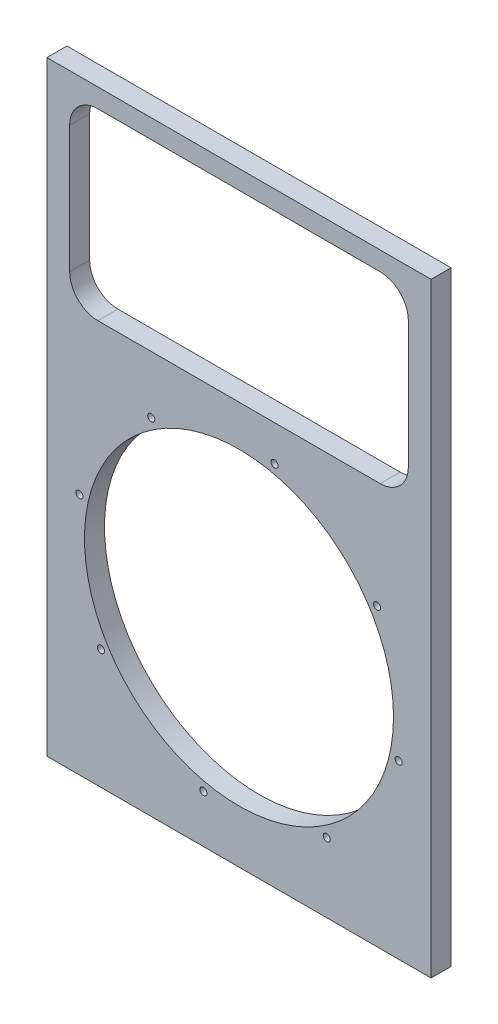
ISO-10303-21;
HEADER;
FILE_DESCRIPTION(('STEP AP214'),'2;1');
FILE_NAME('part.step','',(''),(''),'','','');
FILE_SCHEMA(('AUTOMOTIVE_DESIGN { 1 0 10303 214 1 1 1 1 }'));
ENDSEC;
DATA;
#1=APPLICATION_CONTEXT('core data for automotive mechanical design processes');
#2=APPLICATION_PROTOCOL_DEFINITION('international standard','automotive_design',2000,#1);
#3=PRODUCT_CONTEXT('',#1,'mechanical');
#4=PRODUCT('Part','Part','',(#3));
#5=PRODUCT_RELATED_PRODUCT_CATEGORY('part','',(#4));
#6=PRODUCT_DEFINITION_FORMATION('','',#4);
#7=PRODUCT_DEFINITION_CONTEXT('part definition',#1,'design');
#8=PRODUCT_DEFINITION('design','',#6,#7);
#9=PRODUCT_DEFINITION_SHAPE('','',#8);
#10=(LENGTH_UNIT() NAMED_UNIT(*) SI_UNIT(.MILLI.,.METRE.));
#11=(NAMED_UNIT(*) PLANE_ANGLE_UNIT() SI_UNIT($,.RADIAN.));
#12=(NAMED_UNIT(*) SI_UNIT($,.STERADIAN.) SOLID_ANGLE_UNIT());
#13=UNCERTAINTY_MEASURE_WITH_UNIT(LENGTH_MEASURE(1.E-05),#10,'distance_accuracy_value','');
#14=(GEOMETRIC_REPRESENTATION_CONTEXT(3) GLOBAL_UNCERTAINTY_ASSIGNED_CONTEXT((#13)) GLOBAL_UNIT_ASSIGNED_CONTEXT((#10,
#11,#12)) REPRESENTATION_CONTEXT('',''));
#15=CARTESIAN_POINT('',(0.,0.,0.));
#16=DIRECTION('',(0.,0.,1.));
#17=DIRECTION('',(1.,0.,0.));
#18=AXIS2_PLACEMENT_3D('',#15,#16,#17);
#19=CARTESIAN_POINT('',(0.,0.,18.));
#20=DIRECTION('',(1.,0.,0.));
#21=DIRECTION('',(0.,0.,-1.));
#22=AXIS2_PLACEMENT_3D('',#19,#20,#21);
#23=PLANE('',#22);
#24=DIRECTION('',(0.,-1.,0.));
#25=VECTOR('',#24,1.);
#26=CARTESIAN_POINT('',(0.,0.,0.));
#27=LINE('',#26,#25);
#28=CARTESIAN_POINT('',(0.,544.6,0.));
#29=VERTEX_POINT('',#28);
#30=CARTESIAN_POINT('',(0.,0.,0.));
#31=VERTEX_POINT('',#30);
#32=EDGE_CURVE('E243',#29,#31,#27,.T.);
#33=ORIENTED_EDGE('',*,*,#32,.T.);
#34=DIRECTION('',(0.,0.,-1.));
#35=VECTOR('',#34,1.);
#36=CARTESIAN_POINT('',(0.,0.,18.));
#37=LINE('',#36,#35);
#38=CARTESIAN_POINT('',(0.,0.,18.));
#39=VERTEX_POINT('',#38);
#40=EDGE_CURVE('E11',#39,#31,#37,.T.);
#41=ORIENTED_EDGE('',*,*,#40,.F.);
#42=DIRECTION('',(0.,-1.,0.));
#43=VECTOR('',#42,1.);
#44=CARTESIAN_POINT('',(0.,0.,18.));
#45=LINE('',#44,#43);
#46=CARTESIAN_POINT('',(0.,544.6,18.));
#47=VERTEX_POINT('',#46);
#48=EDGE_CURVE('E246',#47,#39,#45,.T.);
#49=ORIENTED_EDGE('',*,*,#48,.F.);
#50=DIRECTION('',(0.,0.,-1.));
#51=VECTOR('',#50,1.);
#52=CARTESIAN_POINT('',(0.,544.6,18.));
#53=LINE('',#52,#51);
#54=EDGE_CURVE('E256',#47,#29,#53,.T.);
#55=ORIENTED_EDGE('',*,*,#54,.T.);
#56=EDGE_LOOP('',(#33,#41,#49,#55));
#57=FACE_BOUND('',#56,.T.);
#58=ADVANCED_FACE('F35',(#57),#23,.F.);
#59=CARTESIAN_POINT('',(0.,0.,18.));
#60=DIRECTION('',(0.,1.,0.));
#61=DIRECTION('',(0.,0.,1.));
#62=AXIS2_PLACEMENT_3D('',#59,#60,#61);
#63=PLANE('',#62);
#64=DIRECTION('',(1.,0.,0.));
#65=VECTOR('',#64,1.);
#66=CARTESIAN_POINT('',(0.,0.,0.));
#67=LINE('',#66,#65);
#68=CARTESIAN_POINT('',(345.7,0.,0.));
#69=VERTEX_POINT('',#68);
#70=EDGE_CURVE('E259',#31,#69,#67,.T.);
#71=ORIENTED_EDGE('',*,*,#70,.T.);
#72=DIRECTION('',(0.,0.,-1.));
#73=VECTOR('',#72,1.);
#74=CARTESIAN_POINT('',(345.7,0.,18.));
#75=LINE('',#74,#73);
#76=CARTESIAN_POINT('',(345.7,0.,18.));
#77=VERTEX_POINT('',#76);
#78=EDGE_CURVE('E42',#77,#69,#75,.T.);
#79=ORIENTED_EDGE('',*,*,#78,.F.);
#80=DIRECTION('',(1.,0.,0.));
#81=VECTOR('',#80,1.);
#82=CARTESIAN_POINT('',(0.,0.,18.));
#83=LINE('',#82,#81);
#84=EDGE_CURVE('E249',#39,#77,#83,.T.);
#85=ORIENTED_EDGE('',*,*,#84,.F.);
#86=ORIENTED_EDGE('',*,*,#40,.T.);
#87=EDGE_LOOP('',(#71,#79,#85,#86));
#88=FACE_BOUND('',#87,.T.);
#89=ADVANCED_FACE('F288',(#88),#63,.F.);
#90=CARTESIAN_POINT('',(345.7,0.,18.));
#91=DIRECTION('',(-1.,0.,0.));
#92=DIRECTION('',(0.,0.,1.));
#93=AXIS2_PLACEMENT_3D('',#90,#91,#92);
#94=PLANE('',#93);
#95=DIRECTION('',(0.,1.,0.));
#96=VECTOR('',#95,1.);
#97=CARTESIAN_POINT('',(345.7,0.,0.));
#98=LINE('',#97,#96);
#99=CARTESIAN_POINT('',(345.7,544.6,0.));
#100=VERTEX_POINT('',#99);
#101=EDGE_CURVE('E261',#69,#100,#98,.T.);
#102=ORIENTED_EDGE('',*,*,#101,.T.);
#103=DIRECTION('',(0.,0.,-1.));
#104=VECTOR('',#103,1.);
#105=CARTESIAN_POINT('',(345.7,544.6,18.));
#106=LINE('',#105,#104);
#107=CARTESIAN_POINT('',(345.7,544.6,18.));
#108=VERTEX_POINT('',#107);
#109=EDGE_CURVE('E266',#108,#100,#106,.T.);
#110=ORIENTED_EDGE('',*,*,#109,.F.);
#111=DIRECTION('',(0.,1.,0.));
#112=VECTOR('',#111,1.);
#113=CARTESIAN_POINT('',(345.7,0.,18.));
#114=LINE('',#113,#112);
#115=EDGE_CURVE('E252',#77,#108,#114,.T.);
#116=ORIENTED_EDGE('',*,*,#115,.F.);
#117=ORIENTED_EDGE('',*,*,#78,.T.);
#118=EDGE_LOOP('',(#102,#110,#116,#117));
#119=FACE_BOUND('',#118,.T.);
#120=ADVANCED_FACE('F273',(#119),#94,.F.);
#121=CARTESIAN_POINT('',(0.,544.6,18.));
#122=DIRECTION('',(0.,-1.,0.));
#123=DIRECTION('',(0.,0.,-1.));
#124=AXIS2_PLACEMENT_3D('',#121,#122,#123);
#125=PLANE('',#124);
#126=DIRECTION('',(-1.,0.,0.));
#127=VECTOR('',#126,1.);
#128=CARTESIAN_POINT('',(0.,544.6,0.));
#129=LINE('',#128,#127);
#130=EDGE_CURVE('E250',#100,#29,#129,.T.);
#131=ORIENTED_EDGE('',*,*,#130,.T.);
#132=ORIENTED_EDGE('',*,*,#54,.F.);
#133=DIRECTION('',(-1.,0.,0.));
#134=VECTOR('',#133,1.);
#135=CARTESIAN_POINT('',(0.,544.6,18.));
#136=LINE('',#135,#134);
#137=EDGE_CURVE('E254',#108,#47,#136,.T.);
#138=ORIENTED_EDGE('',*,*,#137,.F.);
#139=ORIENTED_EDGE('',*,*,#109,.T.);
#140=EDGE_LOOP('',(#131,#132,#138,#139));
#141=FACE_BOUND('',#140,.T.);
#142=ADVANCED_FACE('F281',(#141),#125,.F.);
#143=CARTESIAN_POINT('',(0.,0.,18.));
#144=DIRECTION('',(0.,0.,-1.));
#145=DIRECTION('',(-1.,0.,0.));
#146=AXIS2_PLACEMENT_3D('',#143,#144,#145);
#147=PLANE('',#146);
#148=DIRECTION('',(1.,0.,0.));
#149=VECTOR('',#148,1.);
#150=CARTESIAN_POINT('',(45.8500000000002,362.45,18.));
#151=LINE('',#150,#149);
#152=CARTESIAN_POINT('',(45.8500000000002,362.45,18.));
#153=VERTEX_POINT('',#152);
#154=CARTESIAN_POINT('',(299.85,362.45,18.));
#155=VERTEX_POINT('',#154);
#156=EDGE_CURVE('E162',#153,#155,#151,.T.);
#157=ORIENTED_EDGE('',*,*,#156,.F.);
#158=CARTESIAN_POINT('',(45.85,387.85,18.));
#159=DIRECTION('',(0.,0.,1.));
#160=DIRECTION('',(-1.,0.,0.));
#161=AXIS2_PLACEMENT_3D('',#158,#159,#160);
#162=CIRCLE('',#161,25.4);
#163=CARTESIAN_POINT('',(20.45,387.85,18.));
#164=VERTEX_POINT('',#163);
#165=EDGE_CURVE('E49',#164,#153,#162,.T.);
#166=ORIENTED_EDGE('',*,*,#165,.F.);
#167=DIRECTION('',(0.,-1.,0.));
#168=VECTOR('',#167,1.);
#169=CARTESIAN_POINT('',(20.45,387.85,18.));
#170=LINE('',#169,#168);
#171=CARTESIAN_POINT('',(20.45,502.15,18.));
#172=VERTEX_POINT('',#171);
#173=EDGE_CURVE('E142',#172,#164,#170,.T.);
#174=ORIENTED_EDGE('',*,*,#173,.F.);
#175=CARTESIAN_POINT('',(45.85,502.15,18.));
#176=DIRECTION('',(0.,0.,1.));
#177=DIRECTION('',(-1.,0.,0.));
#178=AXIS2_PLACEMENT_3D('',#175,#176,#177);
#179=CIRCLE('',#178,25.4);
#180=CARTESIAN_POINT('',(45.8500000000002,527.55,18.));
#181=VERTEX_POINT('',#180);
#182=EDGE_CURVE('E145',#181,#172,#179,.T.);
#183=ORIENTED_EDGE('',*,*,#182,.F.);
#184=DIRECTION('',(-1.,0.,0.));
#185=VECTOR('',#184,1.);
#186=CARTESIAN_POINT('',(45.8500000000002,527.55,18.));
#187=LINE('',#186,#185);
#188=CARTESIAN_POINT('',(299.85,527.55,18.));
#189=VERTEX_POINT('',#188);
#190=EDGE_CURVE('E173',#189,#181,#187,.T.);
#191=ORIENTED_EDGE('',*,*,#190,.F.);
#192=CARTESIAN_POINT('',(299.85,502.15,18.));
#193=DIRECTION('',(0.,0.,1.));
#194=DIRECTION('',(-1.,0.,0.));
#195=AXIS2_PLACEMENT_3D('',#192,#193,#194);
#196=CIRCLE('',#195,25.4);
#197=CARTESIAN_POINT('',(325.25,502.15,18.));
#198=VERTEX_POINT('',#197);
#199=EDGE_CURVE('E170',#198,#189,#196,.T.);
#200=ORIENTED_EDGE('',*,*,#199,.F.);
#201=DIRECTION('',(0.,1.,0.));
#202=VECTOR('',#201,1.);
#203=CARTESIAN_POINT('',(325.25,387.85,18.));
#204=LINE('',#203,#202);
#205=CARTESIAN_POINT('',(325.25,387.85,18.));
#206=VERTEX_POINT('',#205);
#207=EDGE_CURVE('E167',#206,#198,#204,.T.);
#208=ORIENTED_EDGE('',*,*,#207,.F.);
#209=CARTESIAN_POINT('',(299.85,387.85,18.));
#210=DIRECTION('',(0.,0.,1.));
#211=DIRECTION('',(1.,0.,0.));
#212=AXIS2_PLACEMENT_3D('',#209,#210,#211);
#213=CIRCLE('',#212,25.4);
#214=EDGE_CURVE('E164',#155,#206,#213,.T.);
#215=ORIENTED_EDGE('',*,*,#214,.F.);
#216=EDGE_LOOP('',(#157,#166,#174,#183,#191,#200,#208,#215));
#217=FACE_BOUND('',#216,.T.);
#218=CARTESIAN_POINT('',(93.8788571551372,310.905851568658,18.));
#219=DIRECTION('',(0.,0.,1.));
#220=DIRECTION('',(1.,0.,0.));
#221=AXIS2_PLACEMENT_3D('',#218,#219,#220);
#222=CIRCLE('',#221,3.17499999999666);
#223=CARTESIAN_POINT('',(97.0538571551338,310.905851568658,18.));
#224=VERTEX_POINT('',#223);
#225=EDGE_CURVE('E180',#224,#224,#222,.T.);
#226=ORIENTED_EDGE('',*,*,#225,.F.);
#227=EDGE_LOOP('',(#226));
#228=FACE_BOUND('',#227,.T.);
#229=CARTESIAN_POINT('',(29.1757813242883,218.683123227375,18.));
#230=DIRECTION('',(0.,0.,1.));
#231=DIRECTION('',(1.,0.,0.));
#232=AXIS2_PLACEMENT_3D('',#229,#230,#231);
#233=CIRCLE('',#232,3.17499999999039);
#234=CARTESIAN_POINT('',(32.3507813242787,218.683123227375,18.));
#235=VERTEX_POINT('',#234);
#236=EDGE_CURVE('E195',#235,#235,#233,.T.);
#237=ORIENTED_EDGE('',*,*,#236,.F.);
#238=EDGE_LOOP('',(#237));
#239=FACE_BOUND('',#238,.T.);
#240=CARTESIAN_POINT('',(48.6351142303137,107.719822954109,18.));
#241=DIRECTION('',(0.,0.,1.));
#242=DIRECTION('',(1.,0.,0.));
#243=AXIS2_PLACEMENT_3D('',#240,#241,#242);
#244=CIRCLE('',#243,3.17499999998635);
#245=CARTESIAN_POINT('',(51.8101142303,107.719822954109,18.));
#246=VERTEX_POINT('',#245);
#247=EDGE_CURVE('E201',#246,#246,#244,.T.);
#248=ORIENTED_EDGE('',*,*,#247,.F.);
#249=EDGE_LOOP('',(#248));
#250=FACE_BOUND('',#249,.T.);
#251=CARTESIAN_POINT('',(140.857842571597,43.0167471232602,18.));
#252=DIRECTION('',(0.,0.,1.));
#253=DIRECTION('',(1.,0.,0.));
#254=AXIS2_PLACEMENT_3D('',#251,#252,#253);
#255=CIRCLE('',#254,3.1749999999869);
#256=CARTESIAN_POINT('',(144.032842571583,43.0167471232602,18.));
#257=VERTEX_POINT('',#256);
#258=EDGE_CURVE('E207',#257,#257,#255,.T.);
#259=ORIENTED_EDGE('',*,*,#258,.F.);
#260=EDGE_LOOP('',(#259));
#261=FACE_BOUND('',#260,.T.);
#262=CARTESIAN_POINT('',(251.821142844863,62.4760800292856,18.));
#263=DIRECTION('',(0.,0.,1.));
#264=DIRECTION('',(1.,0.,0.));
#265=AXIS2_PLACEMENT_3D('',#262,#263,#264);
#266=CIRCLE('',#265,3.17499999999172);
#267=CARTESIAN_POINT('',(254.996142844855,62.4760800292856,18.));
#268=VERTEX_POINT('',#267);
#269=EDGE_CURVE('E213',#268,#268,#266,.T.);
#270=ORIENTED_EDGE('',*,*,#269,.F.);
#271=EDGE_LOOP('',(#270));
#272=FACE_BOUND('',#271,.T.);
#273=CARTESIAN_POINT('',(316.524218675712,154.698808370568,18.));
#274=DIRECTION('',(0.,0.,1.));
#275=DIRECTION('',(1.,0.,0.));
#276=AXIS2_PLACEMENT_3D('',#273,#274,#275);
#277=CIRCLE('',#276,3.17499999999751);
#278=CARTESIAN_POINT('',(319.699218675709,154.698808370568,18.));
#279=VERTEX_POINT('',#278);
#280=EDGE_CURVE('E219',#279,#279,#277,.T.);
#281=ORIENTED_EDGE('',*,*,#280,.F.);
#282=EDGE_LOOP('',(#281));
#283=FACE_BOUND('',#282,.T.);
#284=CARTESIAN_POINT('',(297.064885769687,265.662108643835,18.));
#285=DIRECTION('',(0.,0.,1.));
#286=DIRECTION('',(1.,0.,0.));
#287=AXIS2_PLACEMENT_3D('',#284,#285,#286);
#288=CIRCLE('',#287,3.175000000001);
#289=CARTESIAN_POINT('',(300.239885769688,265.662108643835,18.));
#290=VERTEX_POINT('',#289);
#291=EDGE_CURVE('E225',#290,#290,#288,.T.);
#292=ORIENTED_EDGE('',*,*,#291,.F.);
#293=EDGE_LOOP('',(#292));
#294=FACE_BOUND('',#293,.T.);
#295=CARTESIAN_POINT('',(204.842157428404,330.365184474684,18.));
#296=DIRECTION('',(0.,0.,1.));
#297=DIRECTION('',(1.,0.,0.));
#298=AXIS2_PLACEMENT_3D('',#295,#296,#297);
#299=CIRCLE('',#298,3.175);
#300=CARTESIAN_POINT('',(208.017157428404,330.365184474684,18.));
#301=VERTEX_POINT('',#300);
#302=EDGE_CURVE('E231',#301,#301,#299,.T.);
#303=ORIENTED_EDGE('',*,*,#302,.F.);
#304=EDGE_LOOP('',(#303));
#305=FACE_BOUND('',#304,.T.);
#306=CARTESIAN_POINT('',(172.85,186.690965798972,18.));
#307=DIRECTION('',(0.,0.,1.));
#308=DIRECTION('',(1.,0.,0.));
#309=AXIS2_PLACEMENT_3D('',#306,#307,#308);
#310=CIRCLE('',#309,139.065);
#311=CARTESIAN_POINT('',(311.915,186.690965798972,18.));
#312=VERTEX_POINT('',#311);
#313=EDGE_CURVE('E237',#312,#312,#310,.T.);
#314=ORIENTED_EDGE('',*,*,#313,.F.);
#315=EDGE_LOOP('',(#314));
#316=FACE_BOUND('',#315,.T.);
#317=ORIENTED_EDGE('',*,*,#48,.T.);
#318=ORIENTED_EDGE('',*,*,#84,.T.);
#319=ORIENTED_EDGE('',*,*,#115,.T.);
#320=ORIENTED_EDGE('',*,*,#137,.T.);
#321=EDGE_LOOP('',(#317,#318,#319,#320));
#322=FACE_BOUND('',#321,.T.);
#323=ADVANCED_FACE('F287',(#217,#228,#239,#250,#261,#272,#283,#294,#305,#316,#322),#147,.F.);
#324=CARTESIAN_POINT('',(0.,0.,0.));
#325=DIRECTION('',(0.,0.,-1.));
#326=DIRECTION('',(-1.,0.,0.));
#327=AXIS2_PLACEMENT_3D('',#324,#325,#326);
#328=PLANE('',#327);
#329=CARTESIAN_POINT('',(45.85,387.85,0.));
#330=DIRECTION('',(0.,0.,1.));
#331=DIRECTION('',(-1.,0.,0.));
#332=AXIS2_PLACEMENT_3D('',#329,#330,#331);
#333=CIRCLE('',#332,25.4);
#334=CARTESIAN_POINT('',(20.45,387.85,0.));
#335=VERTEX_POINT('',#334);
#336=CARTESIAN_POINT('',(45.8500000000002,362.45,0.));
#337=VERTEX_POINT('',#336);
#338=EDGE_CURVE('E125',#335,#337,#333,.T.);
#339=ORIENTED_EDGE('',*,*,#338,.T.);
#340=DIRECTION('',(1.,0.,0.));
#341=VECTOR('',#340,1.);
#342=CARTESIAN_POINT('',(45.8500000000002,362.45,0.));
#343=LINE('',#342,#341);
#344=CARTESIAN_POINT('',(299.85,362.45,0.));
#345=VERTEX_POINT('',#344);
#346=EDGE_CURVE('E134',#337,#345,#343,.T.);
#347=ORIENTED_EDGE('',*,*,#346,.T.);
#348=CARTESIAN_POINT('',(299.85,387.85,0.));
#349=DIRECTION('',(0.,0.,1.));
#350=DIRECTION('',(1.,0.,0.));
#351=AXIS2_PLACEMENT_3D('',#348,#349,#350);
#352=CIRCLE('',#351,25.4);
#353=CARTESIAN_POINT('',(325.25,387.85,0.));
#354=VERTEX_POINT('',#353);
#355=EDGE_CURVE('E57',#345,#354,#352,.T.);
#356=ORIENTED_EDGE('',*,*,#355,.T.);
#357=DIRECTION('',(0.,1.,0.));
#358=VECTOR('',#357,1.);
#359=CARTESIAN_POINT('',(325.25,387.85,0.));
#360=LINE('',#359,#358);
#361=CARTESIAN_POINT('',(325.25,502.15,0.));
#362=VERTEX_POINT('',#361);
#363=EDGE_CURVE('E149',#354,#362,#360,.T.);
#364=ORIENTED_EDGE('',*,*,#363,.T.);
#365=CARTESIAN_POINT('',(299.85,502.15,0.));
#366=DIRECTION('',(0.,0.,1.));
#367=DIRECTION('',(-1.,0.,0.));
#368=AXIS2_PLACEMENT_3D('',#365,#366,#367);
#369=CIRCLE('',#368,25.4);
#370=CARTESIAN_POINT('',(299.85,527.55,0.));
#371=VERTEX_POINT('',#370);
#372=EDGE_CURVE('E152',#362,#371,#369,.T.);
#373=ORIENTED_EDGE('',*,*,#372,.T.);
#374=DIRECTION('',(-1.,0.,0.));
#375=VECTOR('',#374,1.);
#376=CARTESIAN_POINT('',(45.8500000000002,527.55,0.));
#377=LINE('',#376,#375);
#378=CARTESIAN_POINT('',(45.8500000000002,527.55,0.));
#379=VERTEX_POINT('',#378);
#380=EDGE_CURVE('E155',#371,#379,#377,.T.);
#381=ORIENTED_EDGE('',*,*,#380,.T.);
#382=CARTESIAN_POINT('',(45.85,502.15,0.));
#383=DIRECTION('',(0.,0.,1.));
#384=DIRECTION('',(-1.,0.,0.));
#385=AXIS2_PLACEMENT_3D('',#382,#383,#384);
#386=CIRCLE('',#385,25.4);
#387=CARTESIAN_POINT('',(20.45,502.15,0.));
#388=VERTEX_POINT('',#387);
#389=EDGE_CURVE('E158',#379,#388,#386,.T.);
#390=ORIENTED_EDGE('',*,*,#389,.T.);
#391=DIRECTION('',(0.,-1.,0.));
#392=VECTOR('',#391,1.);
#393=CARTESIAN_POINT('',(20.45,387.85,0.));
#394=LINE('',#393,#392);
#395=EDGE_CURVE('E131',#388,#335,#394,.T.);
#396=ORIENTED_EDGE('',*,*,#395,.T.);
#397=EDGE_LOOP('',(#339,#347,#356,#364,#373,#381,#390,#396));
#398=FACE_BOUND('',#397,.T.);
#399=CARTESIAN_POINT('',(93.8788571551372,310.905851568658,0.));
#400=DIRECTION('',(0.,0.,1.));
#401=DIRECTION('',(1.,0.,0.));
#402=AXIS2_PLACEMENT_3D('',#399,#400,#401);
#403=CIRCLE('',#402,3.17499999999666);
#404=CARTESIAN_POINT('',(97.0538571551338,310.905851568658,0.));
#405=VERTEX_POINT('',#404);
#406=EDGE_CURVE('E192',#405,#405,#403,.T.);
#407=ORIENTED_EDGE('',*,*,#406,.T.);
#408=EDGE_LOOP('',(#407));
#409=FACE_BOUND('',#408,.T.);
#410=CARTESIAN_POINT('',(29.1757813242883,218.683123227375,0.));
#411=DIRECTION('',(0.,0.,1.));
#412=DIRECTION('',(1.,0.,0.));
#413=AXIS2_PLACEMENT_3D('',#410,#411,#412);
#414=CIRCLE('',#413,3.17499999999039);
#415=CARTESIAN_POINT('',(32.3507813242787,218.683123227375,0.));
#416=VERTEX_POINT('',#415);
#417=EDGE_CURVE('E198',#416,#416,#414,.T.);
#418=ORIENTED_EDGE('',*,*,#417,.T.);
#419=EDGE_LOOP('',(#418));
#420=FACE_BOUND('',#419,.T.);
#421=CARTESIAN_POINT('',(48.6351142303137,107.719822954109,0.));
#422=DIRECTION('',(0.,0.,1.));
#423=DIRECTION('',(1.,0.,0.));
#424=AXIS2_PLACEMENT_3D('',#421,#422,#423);
#425=CIRCLE('',#424,3.17499999998635);
#426=CARTESIAN_POINT('',(51.8101142303,107.719822954109,0.));
#427=VERTEX_POINT('',#426);
#428=EDGE_CURVE('E204',#427,#427,#425,.T.);
#429=ORIENTED_EDGE('',*,*,#428,.T.);
#430=EDGE_LOOP('',(#429));
#431=FACE_BOUND('',#430,.T.);
#432=CARTESIAN_POINT('',(140.857842571597,43.0167471232602,0.));
#433=DIRECTION('',(0.,0.,1.));
#434=DIRECTION('',(1.,0.,0.));
#435=AXIS2_PLACEMENT_3D('',#432,#433,#434);
#436=CIRCLE('',#435,3.1749999999869);
#437=CARTESIAN_POINT('',(144.032842571583,43.0167471232602,0.));
#438=VERTEX_POINT('',#437);
#439=EDGE_CURVE('E210',#438,#438,#436,.T.);
#440=ORIENTED_EDGE('',*,*,#439,.T.);
#441=EDGE_LOOP('',(#440));
#442=FACE_BOUND('',#441,.T.);
#443=CARTESIAN_POINT('',(251.821142844863,62.4760800292856,0.));
#444=DIRECTION('',(0.,0.,1.));
#445=DIRECTION('',(1.,0.,0.));
#446=AXIS2_PLACEMENT_3D('',#443,#444,#445);
#447=CIRCLE('',#446,3.17499999999172);
#448=CARTESIAN_POINT('',(254.996142844855,62.4760800292856,0.));
#449=VERTEX_POINT('',#448);
#450=EDGE_CURVE('E216',#449,#449,#447,.T.);
#451=ORIENTED_EDGE('',*,*,#450,.T.);
#452=EDGE_LOOP('',(#451));
#453=FACE_BOUND('',#452,.T.);
#454=CARTESIAN_POINT('',(316.524218675712,154.698808370568,0.));
#455=DIRECTION('',(0.,0.,1.));
#456=DIRECTION('',(1.,0.,0.));
#457=AXIS2_PLACEMENT_3D('',#454,#455,#456);
#458=CIRCLE('',#457,3.17499999999751);
#459=CARTESIAN_POINT('',(319.699218675709,154.698808370568,0.));
#460=VERTEX_POINT('',#459);
#461=EDGE_CURVE('E222',#460,#460,#458,.T.);
#462=ORIENTED_EDGE('',*,*,#461,.T.);
#463=EDGE_LOOP('',(#462));
#464=FACE_BOUND('',#463,.T.);
#465=CARTESIAN_POINT('',(297.064885769687,265.662108643835,0.));
#466=DIRECTION('',(0.,0.,1.));
#467=DIRECTION('',(1.,0.,0.));
#468=AXIS2_PLACEMENT_3D('',#465,#466,#467);
#469=CIRCLE('',#468,3.175000000001);
#470=CARTESIAN_POINT('',(300.239885769688,265.662108643835,0.));
#471=VERTEX_POINT('',#470);
#472=EDGE_CURVE('E228',#471,#471,#469,.T.);
#473=ORIENTED_EDGE('',*,*,#472,.T.);
#474=EDGE_LOOP('',(#473));
#475=FACE_BOUND('',#474,.T.);
#476=CARTESIAN_POINT('',(204.842157428404,330.365184474684,0.));
#477=DIRECTION('',(0.,0.,1.));
#478=DIRECTION('',(1.,0.,0.));
#479=AXIS2_PLACEMENT_3D('',#476,#477,#478);
#480=CIRCLE('',#479,3.175);
#481=CARTESIAN_POINT('',(208.017157428404,330.365184474684,0.));
#482=VERTEX_POINT('',#481);
#483=EDGE_CURVE('E234',#482,#482,#480,.T.);
#484=ORIENTED_EDGE('',*,*,#483,.T.);
#485=EDGE_LOOP('',(#484));
#486=FACE_BOUND('',#485,.T.);
#487=CARTESIAN_POINT('',(172.85,186.690965798972,0.));
#488=DIRECTION('',(0.,0.,1.));
#489=DIRECTION('',(1.,0.,0.));
#490=AXIS2_PLACEMENT_3D('',#487,#488,#489);
#491=CIRCLE('',#490,139.065);
#492=CARTESIAN_POINT('',(311.915,186.690965798972,0.));
#493=VERTEX_POINT('',#492);
#494=EDGE_CURVE('E240',#493,#493,#491,.T.);
#495=ORIENTED_EDGE('',*,*,#494,.T.);
#496=EDGE_LOOP('',(#495));
#497=FACE_BOUND('',#496,.T.);
#498=ORIENTED_EDGE('',*,*,#32,.F.);
#499=ORIENTED_EDGE('',*,*,#130,.F.);
#500=ORIENTED_EDGE('',*,*,#101,.F.);
#501=ORIENTED_EDGE('',*,*,#70,.F.);
#502=EDGE_LOOP('',(#498,#499,#500,#501));
#503=FACE_BOUND('',#502,.T.);
#504=ADVANCED_FACE('F138',(#398,#409,#420,#431,#442,#453,#464,#475,#486,#497,#503),#328,.T.);
#505=CARTESIAN_POINT('',(172.85,186.690965798972,0.));
#506=DIRECTION('',(0.,0.,1.));
#507=DIRECTION('',(1.,0.,0.));
#508=AXIS2_PLACEMENT_3D('',#505,#506,#507);
#509=CYLINDRICAL_SURFACE('',#508,139.065);
#510=ORIENTED_EDGE('',*,*,#494,.F.);
#511=EDGE_LOOP('',(#510));
#512=FACE_BOUND('',#511,.T.);
#513=ORIENTED_EDGE('',*,*,#313,.T.);
#514=EDGE_LOOP('',(#513));
#515=FACE_BOUND('',#514,.T.);
#516=ADVANCED_FACE('F300',(#512,#515),#509,.F.);
#517=CARTESIAN_POINT('',(204.842157428404,330.365184474684,0.));
#518=DIRECTION('',(0.,0.,1.));
#519=DIRECTION('',(1.,0.,0.));
#520=AXIS2_PLACEMENT_3D('',#517,#518,#519);
#521=CYLINDRICAL_SURFACE('',#520,3.175);
#522=ORIENTED_EDGE('',*,*,#483,.F.);
#523=EDGE_LOOP('',(#522));
#524=FACE_BOUND('',#523,.T.);
#525=ORIENTED_EDGE('',*,*,#302,.T.);
#526=EDGE_LOOP('',(#525));
#527=FACE_BOUND('',#526,.T.);
#528=ADVANCED_FACE('F306',(#524,#527),#521,.F.);
#529=CARTESIAN_POINT('',(297.064885769687,265.662108643835,0.));
#530=DIRECTION('',(0.,0.,1.));
#531=DIRECTION('',(1.,0.,0.));
#532=AXIS2_PLACEMENT_3D('',#529,#530,#531);
#533=CYLINDRICAL_SURFACE('',#532,3.175000000001);
#534=ORIENTED_EDGE('',*,*,#472,.F.);
#535=EDGE_LOOP('',(#534));
#536=FACE_BOUND('',#535,.T.);
#537=ORIENTED_EDGE('',*,*,#291,.T.);
#538=EDGE_LOOP('',(#537));
#539=FACE_BOUND('',#538,.T.);
#540=ADVANCED_FACE('F310',(#536,#539),#533,.F.);
#541=CARTESIAN_POINT('',(316.524218675712,154.698808370568,0.));
#542=DIRECTION('',(0.,0.,1.));
#543=DIRECTION('',(1.,0.,0.));
#544=AXIS2_PLACEMENT_3D('',#541,#542,#543);
#545=CYLINDRICAL_SURFACE('',#544,3.17499999999751);
#546=ORIENTED_EDGE('',*,*,#461,.F.);
#547=EDGE_LOOP('',(#546));
#548=FACE_BOUND('',#547,.T.);
#549=ORIENTED_EDGE('',*,*,#280,.T.);
#550=EDGE_LOOP('',(#549));
#551=FACE_BOUND('',#550,.T.);
#552=ADVANCED_FACE('F314',(#548,#551),#545,.F.);
#553=CARTESIAN_POINT('',(251.821142844863,62.4760800292856,0.));
#554=DIRECTION('',(0.,0.,1.));
#555=DIRECTION('',(1.,0.,0.));
#556=AXIS2_PLACEMENT_3D('',#553,#554,#555);
#557=CYLINDRICAL_SURFACE('',#556,3.17499999999172);
#558=ORIENTED_EDGE('',*,*,#450,.F.);
#559=EDGE_LOOP('',(#558));
#560=FACE_BOUND('',#559,.T.);
#561=ORIENTED_EDGE('',*,*,#269,.T.);
#562=EDGE_LOOP('',(#561));
#563=FACE_BOUND('',#562,.T.);
#564=ADVANCED_FACE('F318',(#560,#563),#557,.F.);
#565=CARTESIAN_POINT('',(140.857842571597,43.0167471232602,0.));
#566=DIRECTION('',(0.,0.,1.));
#567=DIRECTION('',(1.,0.,0.));
#568=AXIS2_PLACEMENT_3D('',#565,#566,#567);
#569=CYLINDRICAL_SURFACE('',#568,3.1749999999869);
#570=ORIENTED_EDGE('',*,*,#439,.F.);
#571=EDGE_LOOP('',(#570));
#572=FACE_BOUND('',#571,.T.);
#573=ORIENTED_EDGE('',*,*,#258,.T.);
#574=EDGE_LOOP('',(#573));
#575=FACE_BOUND('',#574,.T.);
#576=ADVANCED_FACE('F322',(#572,#575),#569,.F.);
#577=CARTESIAN_POINT('',(48.6351142303137,107.719822954109,0.));
#578=DIRECTION('',(0.,0.,1.));
#579=DIRECTION('',(1.,0.,0.));
#580=AXIS2_PLACEMENT_3D('',#577,#578,#579);
#581=CYLINDRICAL_SURFACE('',#580,3.17499999998635);
#582=ORIENTED_EDGE('',*,*,#428,.F.);
#583=EDGE_LOOP('',(#582));
#584=FACE_BOUND('',#583,.T.);
#585=ORIENTED_EDGE('',*,*,#247,.T.);
#586=EDGE_LOOP('',(#585));
#587=FACE_BOUND('',#586,.T.);
#588=ADVANCED_FACE('F326',(#584,#587),#581,.F.);
#589=CARTESIAN_POINT('',(29.1757813242883,218.683123227375,0.));
#590=DIRECTION('',(0.,0.,1.));
#591=DIRECTION('',(1.,0.,0.));
#592=AXIS2_PLACEMENT_3D('',#589,#590,#591);
#593=CYLINDRICAL_SURFACE('',#592,3.17499999999039);
#594=ORIENTED_EDGE('',*,*,#417,.F.);
#595=EDGE_LOOP('',(#594));
#596=FACE_BOUND('',#595,.T.);
#597=ORIENTED_EDGE('',*,*,#236,.T.);
#598=EDGE_LOOP('',(#597));
#599=FACE_BOUND('',#598,.T.);
#600=ADVANCED_FACE('F330',(#596,#599),#593,.F.);
#601=CARTESIAN_POINT('',(93.8788571551372,310.905851568658,0.));
#602=DIRECTION('',(0.,0.,1.));
#603=DIRECTION('',(1.,0.,0.));
#604=AXIS2_PLACEMENT_3D('',#601,#602,#603);
#605=CYLINDRICAL_SURFACE('',#604,3.17499999999666);
#606=ORIENTED_EDGE('',*,*,#406,.F.);
#607=EDGE_LOOP('',(#606));
#608=FACE_BOUND('',#607,.T.);
#609=ORIENTED_EDGE('',*,*,#225,.T.);
#610=EDGE_LOOP('',(#609));
#611=FACE_BOUND('',#610,.T.);
#612=ADVANCED_FACE('F334',(#608,#611),#605,.F.);
#613=CARTESIAN_POINT('',(45.85,387.85,0.));
#614=DIRECTION('',(0.,0.,1.));
#615=DIRECTION('',(1.,0.,0.));
#616=AXIS2_PLACEMENT_3D('',#613,#614,#615);
#617=CYLINDRICAL_SURFACE('',#616,25.4);
#618=ORIENTED_EDGE('',*,*,#165,.T.);
#619=DIRECTION('',(0.,0.,1.));
#620=VECTOR('',#619,1.);
#621=CARTESIAN_POINT('',(45.8500000000002,362.45,0.));
#622=LINE('',#621,#620);
#623=EDGE_CURVE('E121',#337,#153,#622,.T.);
#624=ORIENTED_EDGE('',*,*,#623,.F.);
#625=ORIENTED_EDGE('',*,*,#338,.F.);
#626=DIRECTION('',(0.,0.,1.));
#627=VECTOR('',#626,1.);
#628=CARTESIAN_POINT('',(20.45,387.85,0.));
#629=LINE('',#628,#627);
#630=EDGE_CURVE('E178',#335,#164,#629,.T.);
#631=ORIENTED_EDGE('',*,*,#630,.T.);
#632=EDGE_LOOP('',(#618,#624,#625,#631));
#633=FACE_BOUND('',#632,.T.);
#634=ADVANCED_FACE('F123',(#633),#617,.F.);
#635=CARTESIAN_POINT('',(20.45,387.85,0.));
#636=DIRECTION('',(-1.,0.,0.));
#637=DIRECTION('',(0.,-1.,0.));
#638=AXIS2_PLACEMENT_3D('',#635,#636,#637);
#639=PLANE('',#638);
#640=ORIENTED_EDGE('',*,*,#173,.T.);
#641=ORIENTED_EDGE('',*,*,#630,.F.);
#642=ORIENTED_EDGE('',*,*,#395,.F.);
#643=DIRECTION('',(0.,0.,1.));
#644=VECTOR('',#643,1.);
#645=CARTESIAN_POINT('',(20.45,502.15,0.));
#646=LINE('',#645,#644);
#647=EDGE_CURVE('E181',#388,#172,#646,.T.);
#648=ORIENTED_EDGE('',*,*,#647,.T.);
#649=EDGE_LOOP('',(#640,#641,#642,#648));
#650=FACE_BOUND('',#649,.T.);
#651=ADVANCED_FACE('F341',(#650),#639,.F.);
#652=CARTESIAN_POINT('',(45.85,502.15,0.));
#653=DIRECTION('',(0.,0.,1.));
#654=DIRECTION('',(1.,0.,0.));
#655=AXIS2_PLACEMENT_3D('',#652,#653,#654);
#656=CYLINDRICAL_SURFACE('',#655,25.4);
#657=ORIENTED_EDGE('',*,*,#182,.T.);
#658=ORIENTED_EDGE('',*,*,#647,.F.);
#659=ORIENTED_EDGE('',*,*,#389,.F.);
#660=DIRECTION('',(0.,0.,1.));
#661=VECTOR('',#660,1.);
#662=CARTESIAN_POINT('',(45.8500000000002,527.55,0.));
#663=LINE('',#662,#661);
#664=EDGE_CURVE('E183',#379,#181,#663,.T.);
#665=ORIENTED_EDGE('',*,*,#664,.T.);
#666=EDGE_LOOP('',(#657,#658,#659,#665));
#667=FACE_BOUND('',#666,.T.);
#668=ADVANCED_FACE('F358',(#667),#656,.F.);
#669=CARTESIAN_POINT('',(45.8500000000002,527.55,0.));
#670=DIRECTION('',(0.,1.,0.));
#671=DIRECTION('',(0.,0.,1.));
#672=AXIS2_PLACEMENT_3D('',#669,#670,#671);
#673=PLANE('',#672);
#674=ORIENTED_EDGE('',*,*,#190,.T.);
#675=ORIENTED_EDGE('',*,*,#664,.F.);
#676=ORIENTED_EDGE('',*,*,#380,.F.);
#677=DIRECTION('',(0.,0.,1.));
#678=VECTOR('',#677,1.);
#679=CARTESIAN_POINT('',(299.85,527.55,0.));
#680=LINE('',#679,#678);
#681=EDGE_CURVE('E185',#371,#189,#680,.T.);
#682=ORIENTED_EDGE('',*,*,#681,.T.);
#683=EDGE_LOOP('',(#674,#675,#676,#682));
#684=FACE_BOUND('',#683,.T.);
#685=ADVANCED_FACE('F354',(#684),#673,.F.);
#686=CARTESIAN_POINT('',(299.85,502.15,0.));
#687=DIRECTION('',(0.,0.,1.));
#688=DIRECTION('',(1.,0.,0.));
#689=AXIS2_PLACEMENT_3D('',#686,#687,#688);
#690=CYLINDRICAL_SURFACE('',#689,25.4);
#691=ORIENTED_EDGE('',*,*,#199,.T.);
#692=ORIENTED_EDGE('',*,*,#681,.F.);
#693=ORIENTED_EDGE('',*,*,#372,.F.);
#694=DIRECTION('',(0.,0.,1.));
#695=VECTOR('',#694,1.);
#696=CARTESIAN_POINT('',(325.25,502.15,0.));
#697=LINE('',#696,#695);
#698=EDGE_CURVE('E187',#362,#198,#697,.T.);
#699=ORIENTED_EDGE('',*,*,#698,.T.);
#700=EDGE_LOOP('',(#691,#692,#693,#699));
#701=FACE_BOUND('',#700,.T.);
#702=ADVANCED_FACE('F350',(#701),#690,.F.);
#703=CARTESIAN_POINT('',(325.25,387.85,0.));
#704=DIRECTION('',(1.,0.,0.));
#705=DIRECTION('',(0.,1.,0.));
#706=AXIS2_PLACEMENT_3D('',#703,#704,#705);
#707=PLANE('',#706);
#708=ORIENTED_EDGE('',*,*,#207,.T.);
#709=ORIENTED_EDGE('',*,*,#698,.F.);
#710=ORIENTED_EDGE('',*,*,#363,.F.);
#711=DIRECTION('',(0.,0.,1.));
#712=VECTOR('',#711,1.);
#713=CARTESIAN_POINT('',(325.25,387.85,0.));
#714=LINE('',#713,#712);
#715=EDGE_CURVE('E189',#354,#206,#714,.T.);
#716=ORIENTED_EDGE('',*,*,#715,.T.);
#717=EDGE_LOOP('',(#708,#709,#710,#716));
#718=FACE_BOUND('',#717,.T.);
#719=ADVANCED_FACE('F347',(#718),#707,.F.);
#720=CARTESIAN_POINT('',(299.85,387.85,0.));
#721=DIRECTION('',(0.,0.,1.));
#722=DIRECTION('',(1.,0.,0.));
#723=AXIS2_PLACEMENT_3D('',#720,#721,#722);
#724=CYLINDRICAL_SURFACE('',#723,25.4);
#725=ORIENTED_EDGE('',*,*,#214,.T.);
#726=ORIENTED_EDGE('',*,*,#715,.F.);
#727=ORIENTED_EDGE('',*,*,#355,.F.);
#728=DIRECTION('',(0.,0.,1.));
#729=VECTOR('',#728,1.);
#730=CARTESIAN_POINT('',(299.85,362.45,0.));
#731=LINE('',#730,#729);
#732=EDGE_CURVE('E130',#345,#155,#731,.T.);
#733=ORIENTED_EDGE('',*,*,#732,.T.);
#734=EDGE_LOOP('',(#725,#726,#727,#733));
#735=FACE_BOUND('',#734,.T.);
#736=ADVANCED_FACE('F344',(#735),#724,.F.);
#737=CARTESIAN_POINT('',(45.8500000000002,362.45,0.));
#738=DIRECTION('',(0.,-1.,0.));
#739=DIRECTION('',(1.,0.,0.));
#740=AXIS2_PLACEMENT_3D('',#737,#738,#739);
#741=PLANE('',#740);
#742=ORIENTED_EDGE('',*,*,#156,.T.);
#743=ORIENTED_EDGE('',*,*,#732,.F.);
#744=ORIENTED_EDGE('',*,*,#346,.F.);
#745=ORIENTED_EDGE('',*,*,#623,.T.);
#746=EDGE_LOOP('',(#742,#743,#744,#745));
#747=FACE_BOUND('',#746,.T.);
#748=ADVANCED_FACE('F135',(#747),#741,.F.);
#749=CLOSED_SHELL('',(#58,#89,#120,#142,#323,#504,#516,#528,#540,#552,#564,#576,#588,#600,#612,
#634,#651,#668,#685,#702,#719,#736,#748));
#750=MANIFOLD_SOLID_BREP('B2',#749);
#751=ADVANCED_BREP_SHAPE_REPRESENTATION('',(#18,#750),#14);
#752=SHAPE_DEFINITION_REPRESENTATION(#9,#751);
ENDSEC;
END-ISO-10303-21;
